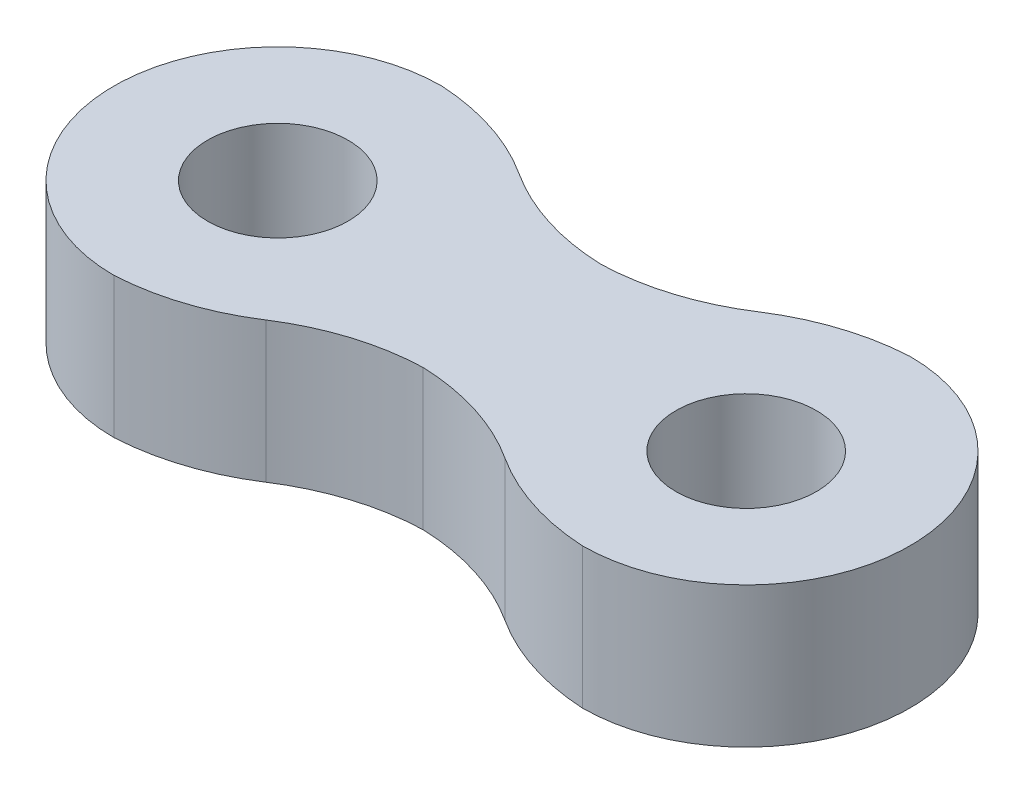
ISO-10303-21;
HEADER;
FILE_DESCRIPTION(('STEP AP214'),'2;1');
FILE_NAME('part.step','',(''),(''),'','','');
FILE_SCHEMA(('AUTOMOTIVE_DESIGN { 1 0 10303 214 1 1 1 1 }'));
ENDSEC;
DATA;
#1=APPLICATION_CONTEXT('core data for automotive mechanical design processes');
#2=APPLICATION_PROTOCOL_DEFINITION('international standard','automotive_design',2000,#1);
#3=PRODUCT_CONTEXT('',#1,'mechanical');
#4=PRODUCT('Part','Part','',(#3));
#5=PRODUCT_RELATED_PRODUCT_CATEGORY('part','',(#4));
#6=PRODUCT_DEFINITION_FORMATION('','',#4);
#7=PRODUCT_DEFINITION_CONTEXT('part definition',#1,'design');
#8=PRODUCT_DEFINITION('design','',#6,#7);
#9=PRODUCT_DEFINITION_SHAPE('','',#8);
#10=(LENGTH_UNIT() NAMED_UNIT(*) SI_UNIT(.MILLI.,.METRE.));
#11=(NAMED_UNIT(*) PLANE_ANGLE_UNIT() SI_UNIT($,.RADIAN.));
#12=(NAMED_UNIT(*) SI_UNIT($,.STERADIAN.) SOLID_ANGLE_UNIT());
#13=UNCERTAINTY_MEASURE_WITH_UNIT(LENGTH_MEASURE(1.E-05),#10,'distance_accuracy_value','');
#14=(GEOMETRIC_REPRESENTATION_CONTEXT(3) GLOBAL_UNCERTAINTY_ASSIGNED_CONTEXT((#13)) GLOBAL_UNIT_ASSIGNED_CONTEXT((#10,
#11,#12)) REPRESENTATION_CONTEXT('',''));
#15=CARTESIAN_POINT('',(0.,0.,0.));
#16=DIRECTION('',(0.,0.,1.));
#17=DIRECTION('',(1.,0.,0.));
#18=AXIS2_PLACEMENT_3D('',#15,#16,#17);
#19=CARTESIAN_POINT('',(-5.,1.5,0.));
#20=DIRECTION('',(0.,1.,0.));
#21=DIRECTION('',(0.,0.,1.));
#22=AXIS2_PLACEMENT_3D('',#19,#20,#21);
#23=PLANE('',#22);
#24=CARTESIAN_POINT('',(-5.,1.5,0.));
#25=DIRECTION('',(0.,1.,0.));
#26=DIRECTION('',(0.,0.,1.));
#27=AXIS2_PLACEMENT_3D('',#24,#25,#26);
#28=CIRCLE('',#27,3.5);
#29=CARTESIAN_POINT('',(-5.,1.5,-3.5));
#30=VERTEX_POINT('',#29);
#31=CARTESIAN_POINT('',(-5.,1.5,3.5));
#32=VERTEX_POINT('',#31);
#33=EDGE_CURVE('E127',#30,#32,#28,.T.);
#34=ORIENTED_EDGE('',*,*,#33,.T.);
#35=CARTESIAN_POINT('',(-5.27117967879201,1.5,-1.49264074231366));
#36=DIRECTION('',(0.,1.,0.));
#37=DIRECTION('',(0.,0.,1.));
#38=AXIS2_PLACEMENT_3D('',#35,#36,#37);
#39=CIRCLE('',#38,5.);
#40=CARTESIAN_POINT('',(-2.55255956141367,1.5,2.70367962884317));
#41=VERTEX_POINT('',#40);
#42=EDGE_CURVE('E115',#32,#41,#39,.T.);
#43=ORIENTED_EDGE('',*,*,#42,.T.);
#44=CARTESIAN_POINT('',(0.166060555964672,1.5,6.9));
#45=DIRECTION('',(0.,1.,0.));
#46=DIRECTION('',(0.,0.,1.));
#47=AXIS2_PLACEMENT_3D('',#44,#45,#46);
#48=CIRCLE('',#47,5.);
#49=CARTESIAN_POINT('',(0.,1.5,1.90275837168617));
#50=VERTEX_POINT('',#49);
#51=EDGE_CURVE('E153',#41,#50,#48,.F.);
#52=ORIENTED_EDGE('',*,*,#51,.T.);
#53=CARTESIAN_POINT('',(-0.166060555964665,1.5,6.9));
#54=DIRECTION('',(0.,1.,0.));
#55=DIRECTION('',(0.,0.,1.));
#56=AXIS2_PLACEMENT_3D('',#53,#54,#55);
#57=CIRCLE('',#56,5.);
#58=CARTESIAN_POINT('',(2.55255956141367,1.5,2.70367962884317));
#59=VERTEX_POINT('',#58);
#60=EDGE_CURVE('E138',#50,#59,#57,.F.);
#61=ORIENTED_EDGE('',*,*,#60,.T.);
#62=CARTESIAN_POINT('',(5.27117967879201,1.5,-1.49264074231366));
#63=DIRECTION('',(0.,1.,0.));
#64=DIRECTION('',(0.,0.,1.));
#65=AXIS2_PLACEMENT_3D('',#62,#63,#64);
#66=CIRCLE('',#65,5.);
#67=CARTESIAN_POINT('',(5.,1.5,3.5));
#68=VERTEX_POINT('',#67);
#69=EDGE_CURVE('E162',#59,#68,#66,.T.);
#70=ORIENTED_EDGE('',*,*,#69,.T.);
#71=CARTESIAN_POINT('',(5.,1.5,0.));
#72=DIRECTION('',(0.,1.,0.));
#73=DIRECTION('',(0.,0.,1.));
#74=AXIS2_PLACEMENT_3D('',#71,#72,#73);
#75=CIRCLE('',#74,3.5);
#76=CARTESIAN_POINT('',(5.,1.5,-3.5));
#77=VERTEX_POINT('',#76);
#78=EDGE_CURVE('E132',#68,#77,#75,.T.);
#79=ORIENTED_EDGE('',*,*,#78,.T.);
#80=CARTESIAN_POINT('',(5.27117967879202,1.5,1.49264074231365));
#81=DIRECTION('',(0.,1.,0.));
#82=DIRECTION('',(0.,0.,1.));
#83=AXIS2_PLACEMENT_3D('',#80,#81,#82);
#84=CIRCLE('',#83,5.);
#85=CARTESIAN_POINT('',(2.55255956141368,1.5,-2.70367962884317));
#86=VERTEX_POINT('',#85);
#87=EDGE_CURVE('E171',#77,#86,#84,.T.);
#88=ORIENTED_EDGE('',*,*,#87,.T.);
#89=CARTESIAN_POINT('',(-0.166060555964665,1.5,-6.9));
#90=DIRECTION('',(0.,1.,0.));
#91=DIRECTION('',(0.,0.,1.));
#92=AXIS2_PLACEMENT_3D('',#89,#90,#91);
#93=CIRCLE('',#92,5.);
#94=CARTESIAN_POINT('',(0.,1.5,-1.90275837168617));
#95=VERTEX_POINT('',#94);
#96=EDGE_CURVE('E149',#86,#95,#93,.F.);
#97=ORIENTED_EDGE('',*,*,#96,.T.);
#98=CARTESIAN_POINT('',(0.166060555964672,1.5,-6.9));
#99=DIRECTION('',(0.,1.,0.));
#100=DIRECTION('',(0.,0.,1.));
#101=AXIS2_PLACEMENT_3D('',#98,#99,#100);
#102=CIRCLE('',#101,5.);
#103=CARTESIAN_POINT('',(-2.55255956141367,1.5,-2.70367962884317));
#104=VERTEX_POINT('',#103);
#105=EDGE_CURVE('E158',#95,#104,#102,.F.);
#106=ORIENTED_EDGE('',*,*,#105,.T.);
#107=CARTESIAN_POINT('',(-5.27117967879201,1.5,1.49264074231366));
#108=DIRECTION('',(0.,1.,0.));
#109=DIRECTION('',(0.,0.,1.));
#110=AXIS2_PLACEMENT_3D('',#107,#108,#109);
#111=CIRCLE('',#110,5.);
#112=EDGE_CURVE('E124',#104,#30,#111,.T.);
#113=ORIENTED_EDGE('',*,*,#112,.T.);
#114=EDGE_LOOP('',(#34,#43,#52,#61,#70,#79,#88,#97,#106,#113));
#115=FACE_BOUND('',#114,.T.);
#116=CARTESIAN_POINT('',(-5.,1.5,0.));
#117=DIRECTION('',(0.,1.,0.));
#118=DIRECTION('',(0.,0.,1.));
#119=AXIS2_PLACEMENT_3D('',#116,#117,#118);
#120=CIRCLE('',#119,1.5);
#121=CARTESIAN_POINT('',(-5.,1.5,1.5));
#122=VERTEX_POINT('',#121);
#123=EDGE_CURVE('E207',#122,#122,#120,.T.);
#124=ORIENTED_EDGE('',*,*,#123,.F.);
#125=EDGE_LOOP('',(#124));
#126=FACE_BOUND('',#125,.T.);
#127=CARTESIAN_POINT('',(5.,1.5,0.));
#128=DIRECTION('',(0.,1.,0.));
#129=DIRECTION('',(0.,0.,1.));
#130=AXIS2_PLACEMENT_3D('',#127,#128,#129);
#131=CIRCLE('',#130,1.5);
#132=CARTESIAN_POINT('',(5.,1.5,1.5));
#133=VERTEX_POINT('',#132);
#134=EDGE_CURVE('E216',#133,#133,#131,.T.);
#135=ORIENTED_EDGE('',*,*,#134,.F.);
#136=EDGE_LOOP('',(#135));
#137=FACE_BOUND('',#136,.T.);
#138=ADVANCED_FACE('F36',(#115,#126,#137),#23,.T.);
#139=CARTESIAN_POINT('',(-5.,-1.5,0.));
#140=DIRECTION('',(0.,1.,0.));
#141=DIRECTION('',(0.,0.,1.));
#142=AXIS2_PLACEMENT_3D('',#139,#140,#141);
#143=PLANE('',#142);
#144=CARTESIAN_POINT('',(0.166060555964672,-1.5,6.9));
#145=DIRECTION('',(0.,1.,0.));
#146=DIRECTION('',(0.,0.,1.));
#147=AXIS2_PLACEMENT_3D('',#144,#145,#146);
#148=CIRCLE('',#147,5.);
#149=CARTESIAN_POINT('',(0.,-1.5,1.90275837168617));
#150=VERTEX_POINT('',#149);
#151=CARTESIAN_POINT('',(-2.55255956141367,-1.5,2.70367962884317));
#152=VERTEX_POINT('',#151);
#153=EDGE_CURVE('E155',#150,#152,#148,.T.);
#154=ORIENTED_EDGE('',*,*,#153,.T.);
#155=CARTESIAN_POINT('',(-5.27117967879201,-1.5,-1.49264074231366));
#156=DIRECTION('',(0.,1.,0.));
#157=DIRECTION('',(0.,0.,1.));
#158=AXIS2_PLACEMENT_3D('',#155,#156,#157);
#159=CIRCLE('',#158,5.);
#160=CARTESIAN_POINT('',(-5.,-1.5,3.5));
#161=VERTEX_POINT('',#160);
#162=EDGE_CURVE('E180',#152,#161,#159,.F.);
#163=ORIENTED_EDGE('',*,*,#162,.T.);
#164=CARTESIAN_POINT('',(-5.,-1.5,0.));
#165=DIRECTION('',(0.,1.,0.));
#166=DIRECTION('',(0.,0.,1.));
#167=AXIS2_PLACEMENT_3D('',#164,#165,#166);
#168=CIRCLE('',#167,3.5);
#169=CARTESIAN_POINT('',(-5.,-1.5,-3.5));
#170=VERTEX_POINT('',#169);
#171=EDGE_CURVE('E137',#170,#161,#168,.T.);
#172=ORIENTED_EDGE('',*,*,#171,.F.);
#173=CARTESIAN_POINT('',(-5.27117967879201,-1.5,1.49264074231366));
#174=DIRECTION('',(0.,1.,0.));
#175=DIRECTION('',(0.,0.,1.));
#176=AXIS2_PLACEMENT_3D('',#173,#174,#175);
#177=CIRCLE('',#176,5.);
#178=CARTESIAN_POINT('',(-2.55255956141367,-1.5,-2.70367962884317));
#179=VERTEX_POINT('',#178);
#180=EDGE_CURVE('E58',#170,#179,#177,.F.);
#181=ORIENTED_EDGE('',*,*,#180,.T.);
#182=CARTESIAN_POINT('',(0.166060555964672,-1.5,-6.9));
#183=DIRECTION('',(0.,1.,0.));
#184=DIRECTION('',(0.,0.,1.));
#185=AXIS2_PLACEMENT_3D('',#182,#183,#184);
#186=CIRCLE('',#185,5.);
#187=CARTESIAN_POINT('',(0.,-1.5,-1.90275837168617));
#188=VERTEX_POINT('',#187);
#189=EDGE_CURVE('E160',#179,#188,#186,.T.);
#190=ORIENTED_EDGE('',*,*,#189,.T.);
#191=CARTESIAN_POINT('',(-0.166060555964665,-1.5,-6.9));
#192=DIRECTION('',(0.,1.,0.));
#193=DIRECTION('',(0.,0.,1.));
#194=AXIS2_PLACEMENT_3D('',#191,#192,#193);
#195=CIRCLE('',#194,5.);
#196=CARTESIAN_POINT('',(2.55255956141368,-1.5,-2.70367962884317));
#197=VERTEX_POINT('',#196);
#198=EDGE_CURVE('E151',#188,#197,#195,.T.);
#199=ORIENTED_EDGE('',*,*,#198,.T.);
#200=CARTESIAN_POINT('',(5.27117967879202,-1.5,1.49264074231365));
#201=DIRECTION('',(0.,1.,0.));
#202=DIRECTION('',(0.,0.,1.));
#203=AXIS2_PLACEMENT_3D('',#200,#201,#202);
#204=CIRCLE('',#203,5.);
#205=CARTESIAN_POINT('',(5.,-1.5,-3.5));
#206=VERTEX_POINT('',#205);
#207=EDGE_CURVE('E177',#197,#206,#204,.F.);
#208=ORIENTED_EDGE('',*,*,#207,.T.);
#209=CARTESIAN_POINT('',(5.,-1.5,0.));
#210=DIRECTION('',(0.,1.,0.));
#211=DIRECTION('',(0.,0.,1.));
#212=AXIS2_PLACEMENT_3D('',#209,#210,#211);
#213=CIRCLE('',#212,3.5);
#214=CARTESIAN_POINT('',(5.,-1.5,3.5));
#215=VERTEX_POINT('',#214);
#216=EDGE_CURVE('E133',#215,#206,#213,.T.);
#217=ORIENTED_EDGE('',*,*,#216,.F.);
#218=CARTESIAN_POINT('',(5.27117967879201,-1.5,-1.49264074231366));
#219=DIRECTION('',(0.,1.,0.));
#220=DIRECTION('',(0.,0.,1.));
#221=AXIS2_PLACEMENT_3D('',#218,#219,#220);
#222=CIRCLE('',#221,5.);
#223=CARTESIAN_POINT('',(2.55255956141367,-1.5,2.70367962884317));
#224=VERTEX_POINT('',#223);
#225=EDGE_CURVE('E175',#215,#224,#222,.F.);
#226=ORIENTED_EDGE('',*,*,#225,.T.);
#227=CARTESIAN_POINT('',(-0.166060555964665,-1.5,6.9));
#228=DIRECTION('',(0.,1.,0.));
#229=DIRECTION('',(0.,0.,1.));
#230=AXIS2_PLACEMENT_3D('',#227,#228,#229);
#231=CIRCLE('',#230,5.);
#232=EDGE_CURVE('E142',#224,#150,#231,.T.);
#233=ORIENTED_EDGE('',*,*,#232,.T.);
#234=EDGE_LOOP('',(#154,#163,#172,#181,#190,#199,#208,#217,#226,#233));
#235=FACE_BOUND('',#234,.T.);
#236=CARTESIAN_POINT('',(-5.,-1.5,0.));
#237=DIRECTION('',(0.,1.,0.));
#238=DIRECTION('',(0.,0.,1.));
#239=AXIS2_PLACEMENT_3D('',#236,#237,#238);
#240=CIRCLE('',#239,1.5);
#241=CARTESIAN_POINT('',(-5.,-1.5,1.5));
#242=VERTEX_POINT('',#241);
#243=EDGE_CURVE('E213',#242,#242,#240,.T.);
#244=ORIENTED_EDGE('',*,*,#243,.T.);
#245=EDGE_LOOP('',(#244));
#246=FACE_BOUND('',#245,.T.);
#247=CARTESIAN_POINT('',(5.,-1.5,0.));
#248=DIRECTION('',(0.,1.,0.));
#249=DIRECTION('',(0.,0.,1.));
#250=AXIS2_PLACEMENT_3D('',#247,#248,#249);
#251=CIRCLE('',#250,1.5);
#252=CARTESIAN_POINT('',(5.,-1.5,1.5));
#253=VERTEX_POINT('',#252);
#254=EDGE_CURVE('E166',#253,#253,#251,.T.);
#255=ORIENTED_EDGE('',*,*,#254,.T.);
#256=EDGE_LOOP('',(#255));
#257=FACE_BOUND('',#256,.T.);
#258=ADVANCED_FACE('F199',(#235,#246,#257),#143,.F.);
#259=CARTESIAN_POINT('',(-5.,1.5,0.));
#260=DIRECTION('',(0.,-1.,0.));
#261=DIRECTION('',(0.,0.,-1.));
#262=AXIS2_PLACEMENT_3D('',#259,#260,#261);
#263=CYLINDRICAL_SURFACE('',#262,3.5);
#264=ORIENTED_EDGE('',*,*,#171,.T.);
#265=DIRECTION('',(0.,-1.,0.));
#266=VECTOR('',#265,1.);
#267=CARTESIAN_POINT('',(-5.,1.5,3.5));
#268=LINE('',#267,#266);
#269=EDGE_CURVE('E120',#32,#161,#268,.T.);
#270=ORIENTED_EDGE('',*,*,#269,.F.);
#271=ORIENTED_EDGE('',*,*,#33,.F.);
#272=DIRECTION('',(0.,-1.,0.));
#273=VECTOR('',#272,1.);
#274=CARTESIAN_POINT('',(-5.,1.5,-3.5));
#275=LINE('',#274,#273);
#276=EDGE_CURVE('E211',#30,#170,#275,.T.);
#277=ORIENTED_EDGE('',*,*,#276,.T.);
#278=EDGE_LOOP('',(#264,#270,#271,#277));
#279=FACE_BOUND('',#278,.T.);
#280=ADVANCED_FACE('F136',(#279),#263,.T.);
#281=CARTESIAN_POINT('',(5.,1.5,0.));
#282=DIRECTION('',(0.,-1.,0.));
#283=DIRECTION('',(0.,0.,-1.));
#284=AXIS2_PLACEMENT_3D('',#281,#282,#283);
#285=CYLINDRICAL_SURFACE('',#284,3.5);
#286=ORIENTED_EDGE('',*,*,#216,.T.);
#287=DIRECTION('',(0.,-1.,0.));
#288=VECTOR('',#287,1.);
#289=CARTESIAN_POINT('',(5.,1.5,-3.5));
#290=LINE('',#289,#288);
#291=EDGE_CURVE('E144',#77,#206,#290,.T.);
#292=ORIENTED_EDGE('',*,*,#291,.F.);
#293=ORIENTED_EDGE('',*,*,#78,.F.);
#294=DIRECTION('',(0.,-1.,0.));
#295=VECTOR('',#294,1.);
#296=CARTESIAN_POINT('',(5.,1.5,3.5));
#297=LINE('',#296,#295);
#298=EDGE_CURVE('E139',#68,#215,#297,.T.);
#299=ORIENTED_EDGE('',*,*,#298,.T.);
#300=EDGE_LOOP('',(#286,#292,#293,#299));
#301=FACE_BOUND('',#300,.T.);
#302=ADVANCED_FACE('F203',(#301),#285,.T.);
#303=CARTESIAN_POINT('',(-5.,1.5,0.));
#304=DIRECTION('',(0.,-1.,0.));
#305=DIRECTION('',(0.,0.,-1.));
#306=AXIS2_PLACEMENT_3D('',#303,#304,#305);
#307=CYLINDRICAL_SURFACE('',#306,1.5);
#308=ORIENTED_EDGE('',*,*,#123,.T.);
#309=EDGE_LOOP('',(#308));
#310=FACE_BOUND('',#309,.T.);
#311=ORIENTED_EDGE('',*,*,#243,.F.);
#312=EDGE_LOOP('',(#311));
#313=FACE_BOUND('',#312,.T.);
#314=ADVANCED_FACE('F234',(#310,#313),#307,.F.);
#315=CARTESIAN_POINT('',(5.,1.5,0.));
#316=DIRECTION('',(0.,-1.,0.));
#317=DIRECTION('',(0.,0.,-1.));
#318=AXIS2_PLACEMENT_3D('',#315,#316,#317);
#319=CYLINDRICAL_SURFACE('',#318,1.5);
#320=ORIENTED_EDGE('',*,*,#134,.T.);
#321=EDGE_LOOP('',(#320));
#322=FACE_BOUND('',#321,.T.);
#323=ORIENTED_EDGE('',*,*,#254,.F.);
#324=EDGE_LOOP('',(#323));
#325=FACE_BOUND('',#324,.T.);
#326=ADVANCED_FACE('F224',(#322,#325),#319,.F.);
#327=CARTESIAN_POINT('',(0.166060555964672,-1.5,6.9));
#328=DIRECTION('',(0.,-1.,0.));
#329=DIRECTION('',(0.,0.,-1.));
#330=AXIS2_PLACEMENT_3D('',#327,#328,#329);
#331=CYLINDRICAL_SURFACE('',#330,5.);
#332=ORIENTED_EDGE('',*,*,#51,.F.);
#333=DIRECTION('',(0.,-1.,0.));
#334=VECTOR('',#333,1.);
#335=CARTESIAN_POINT('',(-2.55255956141367,-1.5,2.70367962884317));
#336=LINE('',#335,#334);
#337=EDGE_CURVE('E121',#41,#152,#336,.T.);
#338=ORIENTED_EDGE('',*,*,#337,.T.);
#339=ORIENTED_EDGE('',*,*,#153,.F.);
#340=DIRECTION('',(0.,-1.,0.));
#341=VECTOR('',#340,1.);
#342=CARTESIAN_POINT('',(0.,0.,1.90275837168617));
#343=LINE('',#342,#341);
#344=EDGE_CURVE('E163',#50,#150,#343,.T.);
#345=ORIENTED_EDGE('',*,*,#344,.F.);
#346=EDGE_LOOP('',(#332,#338,#339,#345));
#347=FACE_BOUND('',#346,.T.);
#348=ADVANCED_FACE('F244',(#347),#331,.F.);
#349=CARTESIAN_POINT('',(-0.166060555964665,-1.5,6.9));
#350=DIRECTION('',(0.,1.,0.));
#351=DIRECTION('',(0.,0.,1.));
#352=AXIS2_PLACEMENT_3D('',#349,#350,#351);
#353=CYLINDRICAL_SURFACE('',#352,5.);
#354=ORIENTED_EDGE('',*,*,#232,.F.);
#355=DIRECTION('',(0.,1.,0.));
#356=VECTOR('',#355,1.);
#357=CARTESIAN_POINT('',(2.55255956141367,-1.5,2.70367962884317));
#358=LINE('',#357,#356);
#359=EDGE_CURVE('E11',#224,#59,#358,.T.);
#360=ORIENTED_EDGE('',*,*,#359,.T.);
#361=ORIENTED_EDGE('',*,*,#60,.F.);
#362=ORIENTED_EDGE('',*,*,#344,.T.);
#363=EDGE_LOOP('',(#354,#360,#361,#362));
#364=FACE_BOUND('',#363,.T.);
#365=ADVANCED_FACE('F241',(#364),#353,.F.);
#366=CARTESIAN_POINT('',(0.166060555964672,-1.5,-6.9));
#367=DIRECTION('',(0.,1.,0.));
#368=DIRECTION('',(0.,0.,1.));
#369=AXIS2_PLACEMENT_3D('',#366,#367,#368);
#370=CYLINDRICAL_SURFACE('',#369,5.);
#371=ORIENTED_EDGE('',*,*,#189,.F.);
#372=DIRECTION('',(0.,1.,0.));
#373=VECTOR('',#372,1.);
#374=CARTESIAN_POINT('',(-2.55255956141367,-1.5,-2.70367962884317));
#375=LINE('',#374,#373);
#376=EDGE_CURVE('E182',#179,#104,#375,.T.);
#377=ORIENTED_EDGE('',*,*,#376,.T.);
#378=ORIENTED_EDGE('',*,*,#105,.F.);
#379=DIRECTION('',(0.,1.,0.));
#380=VECTOR('',#379,1.);
#381=CARTESIAN_POINT('',(0.,0.,-1.90275837168617));
#382=LINE('',#381,#380);
#383=EDGE_CURVE('E167',#188,#95,#382,.T.);
#384=ORIENTED_EDGE('',*,*,#383,.F.);
#385=EDGE_LOOP('',(#371,#377,#378,#384));
#386=FACE_BOUND('',#385,.T.);
#387=ADVANCED_FACE('F187',(#386),#370,.F.);
#388=CARTESIAN_POINT('',(-0.166060555964665,-1.5,-6.9));
#389=DIRECTION('',(0.,-1.,0.));
#390=DIRECTION('',(0.,0.,-1.));
#391=AXIS2_PLACEMENT_3D('',#388,#389,#390);
#392=CYLINDRICAL_SURFACE('',#391,5.);
#393=ORIENTED_EDGE('',*,*,#96,.F.);
#394=DIRECTION('',(0.,-1.,0.));
#395=VECTOR('',#394,1.);
#396=CARTESIAN_POINT('',(2.55255956141368,-1.5,-2.70367962884317));
#397=LINE('',#396,#395);
#398=EDGE_CURVE('E44',#86,#197,#397,.T.);
#399=ORIENTED_EDGE('',*,*,#398,.T.);
#400=ORIENTED_EDGE('',*,*,#198,.F.);
#401=ORIENTED_EDGE('',*,*,#383,.T.);
#402=EDGE_LOOP('',(#393,#399,#400,#401));
#403=FACE_BOUND('',#402,.T.);
#404=ADVANCED_FACE('F191',(#403),#392,.F.);
#405=CARTESIAN_POINT('',(-5.27117967879201,-1.5,-1.49264074231366));
#406=DIRECTION('',(0.,1.,0.));
#407=DIRECTION('',(0.,0.,1.));
#408=AXIS2_PLACEMENT_3D('',#405,#406,#407);
#409=CYLINDRICAL_SURFACE('',#408,5.);
#410=ORIENTED_EDGE('',*,*,#162,.F.);
#411=ORIENTED_EDGE('',*,*,#337,.F.);
#412=ORIENTED_EDGE('',*,*,#42,.F.);
#413=ORIENTED_EDGE('',*,*,#269,.T.);
#414=EDGE_LOOP('',(#410,#411,#412,#413));
#415=FACE_BOUND('',#414,.T.);
#416=ADVANCED_FACE('F118',(#415),#409,.T.);
#417=CARTESIAN_POINT('',(-5.27117967879201,1.5,1.49264074231366));
#418=DIRECTION('',(0.,1.,0.));
#419=DIRECTION('',(0.,0.,1.));
#420=AXIS2_PLACEMENT_3D('',#417,#418,#419);
#421=CYLINDRICAL_SURFACE('',#420,5.);
#422=ORIENTED_EDGE('',*,*,#180,.F.);
#423=ORIENTED_EDGE('',*,*,#276,.F.);
#424=ORIENTED_EDGE('',*,*,#112,.F.);
#425=ORIENTED_EDGE('',*,*,#376,.F.);
#426=EDGE_LOOP('',(#422,#423,#424,#425));
#427=FACE_BOUND('',#426,.T.);
#428=ADVANCED_FACE('F255',(#427),#421,.T.);
#429=CARTESIAN_POINT('',(5.27117967879202,-1.5,1.49264074231365));
#430=DIRECTION('',(0.,1.,0.));
#431=DIRECTION('',(0.,0.,1.));
#432=AXIS2_PLACEMENT_3D('',#429,#430,#431);
#433=CYLINDRICAL_SURFACE('',#432,5.);
#434=ORIENTED_EDGE('',*,*,#207,.F.);
#435=ORIENTED_EDGE('',*,*,#398,.F.);
#436=ORIENTED_EDGE('',*,*,#87,.F.);
#437=ORIENTED_EDGE('',*,*,#291,.T.);
#438=EDGE_LOOP('',(#434,#435,#436,#437));
#439=FACE_BOUND('',#438,.T.);
#440=ADVANCED_FACE('F194',(#439),#433,.T.);
#441=CARTESIAN_POINT('',(5.27117967879201,1.5,-1.49264074231366));
#442=DIRECTION('',(0.,1.,0.));
#443=DIRECTION('',(0.,0.,1.));
#444=AXIS2_PLACEMENT_3D('',#441,#442,#443);
#445=CYLINDRICAL_SURFACE('',#444,5.);
#446=ORIENTED_EDGE('',*,*,#225,.F.);
#447=ORIENTED_EDGE('',*,*,#298,.F.);
#448=ORIENTED_EDGE('',*,*,#69,.F.);
#449=ORIENTED_EDGE('',*,*,#359,.F.);
#450=EDGE_LOOP('',(#446,#447,#448,#449));
#451=FACE_BOUND('',#450,.T.);
#452=ADVANCED_FACE('F38',(#451),#445,.T.);
#453=CLOSED_SHELL('',(#138,#258,#280,#302,#314,#326,#348,#365,#387,#404,#416,#428,#440,#452));
#454=MANIFOLD_SOLID_BREP('B2',#453);
#455=ADVANCED_BREP_SHAPE_REPRESENTATION('',(#18,#454),#14);
#456=SHAPE_DEFINITION_REPRESENTATION(#9,#455);
ENDSEC;
END-ISO-10303-21;
